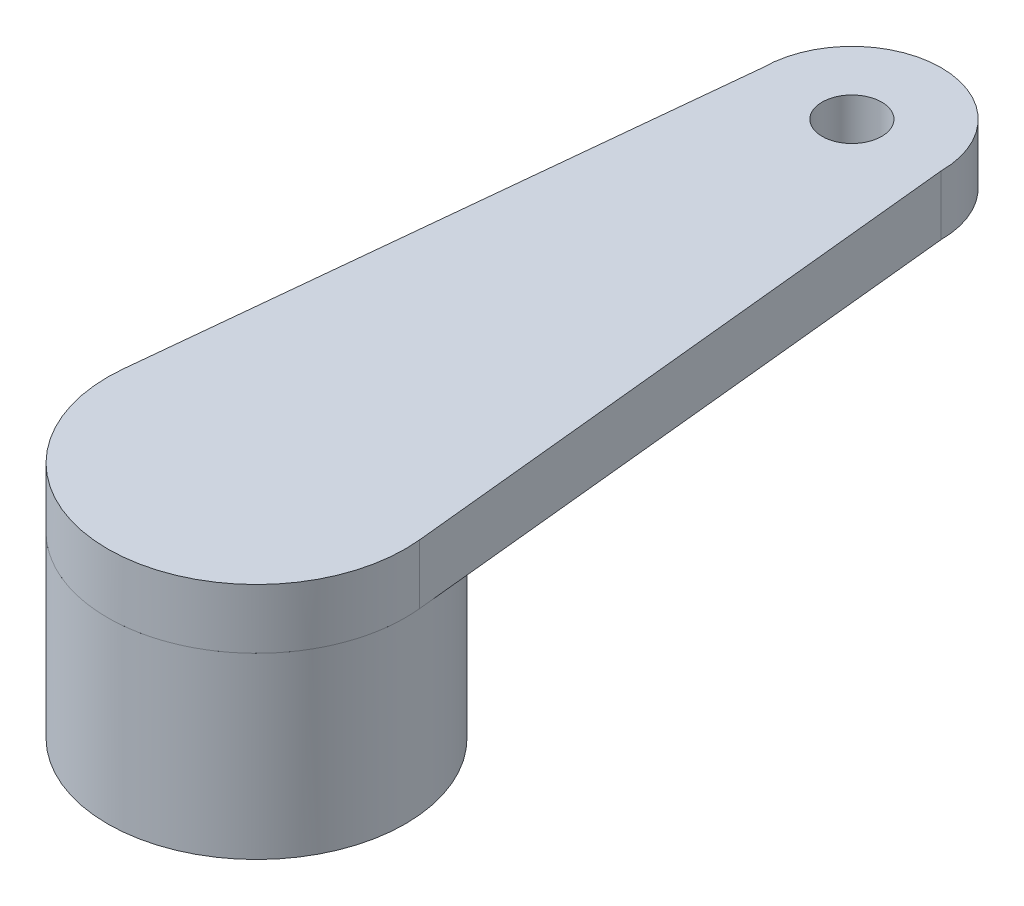
ISO-10303-21;
HEADER;
FILE_DESCRIPTION(('STEP AP214'),'2;1');
FILE_NAME('part.step','',(''),(''),'','','');
FILE_SCHEMA(('AUTOMOTIVE_DESIGN { 1 0 10303 214 1 1 1 1 }'));
ENDSEC;
DATA;
#1=APPLICATION_CONTEXT('core data for automotive mechanical design processes');
#2=APPLICATION_PROTOCOL_DEFINITION('international standard','automotive_design',2000,#1);
#3=PRODUCT_CONTEXT('',#1,'mechanical');
#4=PRODUCT('Part','Part','',(#3));
#5=PRODUCT_RELATED_PRODUCT_CATEGORY('part','',(#4));
#6=PRODUCT_DEFINITION_FORMATION('','',#4);
#7=PRODUCT_DEFINITION_CONTEXT('part definition',#1,'design');
#8=PRODUCT_DEFINITION('design','',#6,#7);
#9=PRODUCT_DEFINITION_SHAPE('','',#8);
#10=(LENGTH_UNIT() NAMED_UNIT(*) SI_UNIT(.MILLI.,.METRE.));
#11=(NAMED_UNIT(*) PLANE_ANGLE_UNIT() SI_UNIT($,.RADIAN.));
#12=(NAMED_UNIT(*) SI_UNIT($,.STERADIAN.) SOLID_ANGLE_UNIT());
#13=UNCERTAINTY_MEASURE_WITH_UNIT(LENGTH_MEASURE(1.E-05),#10,'distance_accuracy_value','');
#14=(GEOMETRIC_REPRESENTATION_CONTEXT(3) GLOBAL_UNCERTAINTY_ASSIGNED_CONTEXT((#13)) GLOBAL_UNIT_ASSIGNED_CONTEXT((#10,
#11,#12)) REPRESENTATION_CONTEXT('',''));
#15=CARTESIAN_POINT('',(0.,0.,0.));
#16=DIRECTION('',(0.,0.,1.));
#17=DIRECTION('',(1.,0.,0.));
#18=AXIS2_PLACEMENT_3D('',#15,#16,#17);
#19=CARTESIAN_POINT('',(0.,3.,0.));
#20=DIRECTION('',(0.,1.,0.));
#21=DIRECTION('',(0.,0.,1.));
#22=AXIS2_PLACEMENT_3D('',#19,#20,#21);
#23=PLANE('',#22);
#24=DIRECTION('',(-0.100759352271469,0.,-0.994910826622082));
#25=VECTOR('',#24,1.);
#26=CARTESIAN_POINT('',(1.5,3.,-10.));
#27=LINE('',#26,#25);
#28=CARTESIAN_POINT('',(2.48723703397788,3.,-0.251894326389127));
#29=VERTEX_POINT('',#28);
#30=CARTESIAN_POINT('',(2.48580786586166,3.,-0.266006116509204));
#31=VERTEX_POINT('',#30);
#32=EDGE_CURVE('E51',#29,#31,#27,.T.);
#33=ORIENTED_EDGE('',*,*,#32,.F.);
#34=CARTESIAN_POINT('',(0.,3.,0.));
#35=DIRECTION('',(0.,1.,0.));
#36=DIRECTION('',(0.,0.,1.));
#37=AXIS2_PLACEMENT_3D('',#34,#35,#36);
#38=CIRCLE('',#37,2.49995976264781);
#39=CARTESIAN_POINT('',(-2.48723703397788,3.,-0.251894326389129));
#40=VERTEX_POINT('',#39);
#41=EDGE_CURVE('E233',#40,#29,#38,.T.);
#42=ORIENTED_EDGE('',*,*,#41,.F.);
#43=DIRECTION('',(-0.100759352271469,0.,0.994910826622082));
#44=VECTOR('',#43,1.);
#45=CARTESIAN_POINT('',(-1.5,3.,-10.));
#46=LINE('',#45,#44);
#47=CARTESIAN_POINT('',(-2.48580786586166,3.,-0.266006116509145));
#48=VERTEX_POINT('',#47);
#49=EDGE_CURVE('E11',#48,#40,#46,.T.);
#50=ORIENTED_EDGE('',*,*,#49,.F.);
#51=CARTESIAN_POINT('',(0.,3.,0.));
#52=DIRECTION('',(0.,1.,0.));
#53=DIRECTION('',(0.,0.,1.));
#54=AXIS2_PLACEMENT_3D('',#51,#52,#53);
#55=CIRCLE('',#54,2.5);
#56=EDGE_CURVE('E117',#48,#31,#55,.T.);
#57=ORIENTED_EDGE('',*,*,#56,.T.);
#58=EDGE_LOOP('',(#33,#42,#50,#57));
#59=FACE_BOUND('',#58,.T.);
#60=ADVANCED_FACE('F33',(#59),#23,.T.);
#61=CARTESIAN_POINT('',(0.,0.,0.));
#62=DIRECTION('',(0.,1.,0.));
#63=DIRECTION('',(0.,0.,1.));
#64=AXIS2_PLACEMENT_3D('',#61,#62,#63);
#65=PLANE('',#64);
#66=CARTESIAN_POINT('',(0.,0.,0.));
#67=DIRECTION('',(0.,1.,0.));
#68=DIRECTION('',(0.,0.,1.));
#69=AXIS2_PLACEMENT_3D('',#66,#67,#68);
#70=CIRCLE('',#69,2.5);
#71=CARTESIAN_POINT('',(0.,0.,2.5));
#72=VERTEX_POINT('',#71);
#73=EDGE_CURVE('E37',#72,#72,#70,.T.);
#74=ORIENTED_EDGE('',*,*,#73,.F.);
#75=EDGE_LOOP('',(#74));
#76=FACE_BOUND('',#75,.T.);
#77=CARTESIAN_POINT('',(0.,0.,0.));
#78=DIRECTION('',(0.,1.,0.));
#79=DIRECTION('',(0.,0.,1.));
#80=AXIS2_PLACEMENT_3D('',#77,#78,#79);
#81=CIRCLE('',#80,1.5);
#82=CARTESIAN_POINT('',(0.,0.,1.5));
#83=VERTEX_POINT('',#82);
#84=EDGE_CURVE('E109',#83,#83,#81,.T.);
#85=ORIENTED_EDGE('',*,*,#84,.T.);
#86=EDGE_LOOP('',(#85));
#87=FACE_BOUND('',#86,.T.);
#88=ADVANCED_FACE('F125',(#76,#87),#65,.F.);
#89=CARTESIAN_POINT('',(0.,3.,0.));
#90=DIRECTION('',(0.,-1.,0.));
#91=DIRECTION('',(0.,0.,-1.));
#92=AXIS2_PLACEMENT_3D('',#89,#90,#91);
#93=CYLINDRICAL_SURFACE('',#92,2.5);
#94=EDGE_CURVE('E42',#31,#48,#55,.T.);
#95=ORIENTED_EDGE('',*,*,#94,.F.);
#96=ORIENTED_EDGE('',*,*,#56,.F.);
#97=EDGE_LOOP('',(#95,#96));
#98=FACE_BOUND('',#97,.T.);
#99=ORIENTED_EDGE('',*,*,#73,.T.);
#100=EDGE_LOOP('',(#99));
#101=FACE_BOUND('',#100,.T.);
#102=ADVANCED_FACE('F35',(#98,#101),#93,.T.);
#103=CARTESIAN_POINT('',(0.,3.,0.));
#104=DIRECTION('',(0.,-1.,0.));
#105=DIRECTION('',(0.,0.,-1.));
#106=AXIS2_PLACEMENT_3D('',#103,#104,#105);
#107=CYLINDRICAL_SURFACE('',#106,1.5);
#108=CARTESIAN_POINT('',(0.,3.,0.));
#109=DIRECTION('',(0.,1.,0.));
#110=DIRECTION('',(0.,0.,1.));
#111=AXIS2_PLACEMENT_3D('',#108,#109,#110);
#112=CIRCLE('',#111,1.5);
#113=CARTESIAN_POINT('',(0.,3.,1.5));
#114=VERTEX_POINT('',#113);
#115=EDGE_CURVE('E106',#114,#114,#112,.T.);
#116=ORIENTED_EDGE('',*,*,#115,.T.);
#117=EDGE_LOOP('',(#116));
#118=FACE_BOUND('',#117,.T.);
#119=ORIENTED_EDGE('',*,*,#84,.F.);
#120=EDGE_LOOP('',(#119));
#121=FACE_BOUND('',#120,.T.);
#122=ADVANCED_FACE('F130',(#118,#121),#107,.F.);
#123=CARTESIAN_POINT('',(0.,4.,-10.));
#124=DIRECTION('',(0.,-1.,0.));
#125=DIRECTION('',(0.,0.,-1.));
#126=AXIS2_PLACEMENT_3D('',#123,#124,#125);
#127=CYLINDRICAL_SURFACE('',#126,0.5);
#128=CARTESIAN_POINT('',(0.,4.,-10.));
#129=DIRECTION('',(0.,1.,0.));
#130=DIRECTION('',(0.,0.,1.));
#131=AXIS2_PLACEMENT_3D('',#128,#129,#130);
#132=CIRCLE('',#131,0.5);
#133=CARTESIAN_POINT('',(0.,4.,-9.5));
#134=VERTEX_POINT('',#133);
#135=EDGE_CURVE('E243',#134,#134,#132,.T.);
#136=ORIENTED_EDGE('',*,*,#135,.T.);
#137=EDGE_LOOP('',(#136));
#138=FACE_BOUND('',#137,.T.);
#139=CARTESIAN_POINT('',(0.,3.,-10.));
#140=DIRECTION('',(0.,1.,0.));
#141=DIRECTION('',(0.,0.,1.));
#142=AXIS2_PLACEMENT_3D('',#139,#140,#141);
#143=CIRCLE('',#142,0.5);
#144=CARTESIAN_POINT('',(0.,3.,-9.5));
#145=VERTEX_POINT('',#144);
#146=EDGE_CURVE('E231',#145,#145,#143,.T.);
#147=ORIENTED_EDGE('',*,*,#146,.F.);
#148=EDGE_LOOP('',(#147));
#149=FACE_BOUND('',#148,.T.);
#150=ADVANCED_FACE('F132',(#138,#149),#127,.F.);
#151=CARTESIAN_POINT('',(1.5,4.,-10.));
#152=DIRECTION('',(-0.994910826622082,0.,0.100759352271469));
#153=DIRECTION('',(0.100759352271469,0.,0.994910826622082));
#154=AXIS2_PLACEMENT_3D('',#151,#152,#153);
#155=PLANE('',#154);
#156=ORIENTED_EDGE('',*,*,#32,.T.);
#157=CARTESIAN_POINT('',(1.5,3.,-10.));
#158=VERTEX_POINT('',#157);
#159=EDGE_CURVE('E232',#31,#158,#27,.T.);
#160=ORIENTED_EDGE('',*,*,#159,.T.);
#161=DIRECTION('',(0.,-1.,0.));
#162=VECTOR('',#161,1.);
#163=CARTESIAN_POINT('',(1.5,4.,-10.));
#164=LINE('',#163,#162);
#165=CARTESIAN_POINT('',(1.5,4.,-10.));
#166=VERTEX_POINT('',#165);
#167=EDGE_CURVE('E239',#166,#158,#164,.T.);
#168=ORIENTED_EDGE('',*,*,#167,.F.);
#169=DIRECTION('',(-0.100759352271469,0.,-0.994910826622082));
#170=VECTOR('',#169,1.);
#171=CARTESIAN_POINT('',(1.5,4.,-10.));
#172=LINE('',#171,#170);
#173=CARTESIAN_POINT('',(2.48723703397788,4.,-0.251894326389127));
#174=VERTEX_POINT('',#173);
#175=EDGE_CURVE('E98',#174,#166,#172,.T.);
#176=ORIENTED_EDGE('',*,*,#175,.F.);
#177=DIRECTION('',(0.,-1.,0.));
#178=VECTOR('',#177,1.);
#179=CARTESIAN_POINT('',(2.48723703397788,4.,-0.251894326389127));
#180=LINE('',#179,#178);
#181=EDGE_CURVE('E111',#174,#29,#180,.T.);
#182=ORIENTED_EDGE('',*,*,#181,.T.);
#183=EDGE_LOOP('',(#156,#160,#168,#176,#182));
#184=FACE_BOUND('',#183,.T.);
#185=ADVANCED_FACE('F139',(#184),#155,.F.);
#186=CARTESIAN_POINT('',(0.,4.,0.));
#187=DIRECTION('',(0.,-1.,0.));
#188=DIRECTION('',(0.,0.,-1.));
#189=AXIS2_PLACEMENT_3D('',#186,#187,#188);
#190=CYLINDRICAL_SURFACE('',#189,2.49995976264781);
#191=ORIENTED_EDGE('',*,*,#41,.T.);
#192=ORIENTED_EDGE('',*,*,#181,.F.);
#193=CARTESIAN_POINT('',(0.,4.,0.));
#194=DIRECTION('',(0.,1.,0.));
#195=DIRECTION('',(0.,0.,1.));
#196=AXIS2_PLACEMENT_3D('',#193,#194,#195);
#197=CIRCLE('',#196,2.49995976264781);
#198=CARTESIAN_POINT('',(-2.48723703397788,4.,-0.251894326389129));
#199=VERTEX_POINT('',#198);
#200=EDGE_CURVE('E91',#199,#174,#197,.T.);
#201=ORIENTED_EDGE('',*,*,#200,.F.);
#202=DIRECTION('',(0.,-1.,0.));
#203=VECTOR('',#202,1.);
#204=CARTESIAN_POINT('',(-2.48723703397788,4.,-0.251894326389129));
#205=LINE('',#204,#203);
#206=EDGE_CURVE('E88',#199,#40,#205,.T.);
#207=ORIENTED_EDGE('',*,*,#206,.T.);
#208=EDGE_LOOP('',(#191,#192,#201,#207));
#209=FACE_BOUND('',#208,.T.);
#210=ADVANCED_FACE('F172',(#209),#190,.T.);
#211=CARTESIAN_POINT('',(-1.5,4.,-10.));
#212=DIRECTION('',(0.994910826622082,0.,0.100759352271469));
#213=DIRECTION('',(0.100759352271469,0.,-0.994910826622082));
#214=AXIS2_PLACEMENT_3D('',#211,#212,#213);
#215=PLANE('',#214);
#216=CARTESIAN_POINT('',(-1.5,3.,-10.));
#217=VERTEX_POINT('',#216);
#218=EDGE_CURVE('E44',#217,#48,#46,.T.);
#219=ORIENTED_EDGE('',*,*,#218,.T.);
#220=ORIENTED_EDGE('',*,*,#49,.T.);
#221=ORIENTED_EDGE('',*,*,#206,.F.);
#222=DIRECTION('',(-0.100759352271469,0.,0.994910826622082));
#223=VECTOR('',#222,1.);
#224=CARTESIAN_POINT('',(-1.5,4.,-10.));
#225=LINE('',#224,#223);
#226=CARTESIAN_POINT('',(-1.5,4.,-10.));
#227=VERTEX_POINT('',#226);
#228=EDGE_CURVE('E80',#227,#199,#225,.T.);
#229=ORIENTED_EDGE('',*,*,#228,.F.);
#230=DIRECTION('',(0.,-1.,0.));
#231=VECTOR('',#230,1.);
#232=CARTESIAN_POINT('',(-1.5,4.,-10.));
#233=LINE('',#232,#231);
#234=EDGE_CURVE('E85',#227,#217,#233,.T.);
#235=ORIENTED_EDGE('',*,*,#234,.T.);
#236=EDGE_LOOP('',(#219,#220,#221,#229,#235));
#237=FACE_BOUND('',#236,.T.);
#238=ADVANCED_FACE('F83',(#237),#215,.F.);
#239=CARTESIAN_POINT('',(0.,4.,-10.));
#240=DIRECTION('',(0.,-1.,0.));
#241=DIRECTION('',(0.,0.,-1.));
#242=AXIS2_PLACEMENT_3D('',#239,#240,#241);
#243=CYLINDRICAL_SURFACE('',#242,1.5);
#244=CARTESIAN_POINT('',(0.,3.,-10.));
#245=DIRECTION('',(0.,1.,0.));
#246=DIRECTION('',(0.,0.,1.));
#247=AXIS2_PLACEMENT_3D('',#244,#245,#246);
#248=CIRCLE('',#247,1.5);
#249=EDGE_CURVE('E105',#158,#217,#248,.T.);
#250=ORIENTED_EDGE('',*,*,#249,.T.);
#251=ORIENTED_EDGE('',*,*,#234,.F.);
#252=CARTESIAN_POINT('',(0.,4.,-10.));
#253=DIRECTION('',(0.,1.,0.));
#254=DIRECTION('',(0.,0.,1.));
#255=AXIS2_PLACEMENT_3D('',#252,#253,#254);
#256=CIRCLE('',#255,1.5);
#257=EDGE_CURVE('E92',#166,#227,#256,.T.);
#258=ORIENTED_EDGE('',*,*,#257,.F.);
#259=ORIENTED_EDGE('',*,*,#167,.T.);
#260=EDGE_LOOP('',(#250,#251,#258,#259));
#261=FACE_BOUND('',#260,.T.);
#262=ADVANCED_FACE('F103',(#261),#243,.T.);
#263=CARTESIAN_POINT('',(0.,4.,-10.));
#264=DIRECTION('',(0.,1.,0.));
#265=DIRECTION('',(0.,0.,1.));
#266=AXIS2_PLACEMENT_3D('',#263,#264,#265);
#267=PLANE('',#266);
#268=ORIENTED_EDGE('',*,*,#257,.T.);
#269=ORIENTED_EDGE('',*,*,#228,.T.);
#270=ORIENTED_EDGE('',*,*,#200,.T.);
#271=ORIENTED_EDGE('',*,*,#175,.T.);
#272=EDGE_LOOP('',(#268,#269,#270,#271));
#273=FACE_BOUND('',#272,.T.);
#274=ORIENTED_EDGE('',*,*,#135,.F.);
#275=EDGE_LOOP('',(#274));
#276=FACE_BOUND('',#275,.T.);
#277=ADVANCED_FACE('F95',(#273,#276),#267,.T.);
#278=CARTESIAN_POINT('',(0.,3.,-10.));
#279=DIRECTION('',(0.,1.,0.));
#280=DIRECTION('',(0.,0.,1.));
#281=AXIS2_PLACEMENT_3D('',#278,#279,#280);
#282=PLANE('',#281);
#283=ORIENTED_EDGE('',*,*,#146,.T.);
#284=EDGE_LOOP('',(#283));
#285=FACE_BOUND('',#284,.T.);
#286=ORIENTED_EDGE('',*,*,#159,.F.);
#287=ORIENTED_EDGE('',*,*,#94,.T.);
#288=ORIENTED_EDGE('',*,*,#218,.F.);
#289=ORIENTED_EDGE('',*,*,#249,.F.);
#290=EDGE_LOOP('',(#286,#287,#288,#289));
#291=FACE_BOUND('',#290,.T.);
#292=ADVANCED_FACE('F206',(#285,#291),#282,.F.);
#293=ORIENTED_EDGE('',*,*,#115,.F.);
#294=EDGE_LOOP('',(#293));
#295=FACE_BOUND('',#294,.T.);
#296=ADVANCED_FACE('F215',(#295),#282,.F.);
#297=CLOSED_SHELL('',(#60,#88,#102,#122,#150,#185,#210,#238,#262,#277,#292,#296));
#298=MANIFOLD_SOLID_BREP('B2',#297);
#299=ADVANCED_BREP_SHAPE_REPRESENTATION('',(#18,#298),#14);
#300=SHAPE_DEFINITION_REPRESENTATION(#9,#299);
ENDSEC;
END-ISO-10303-21;
